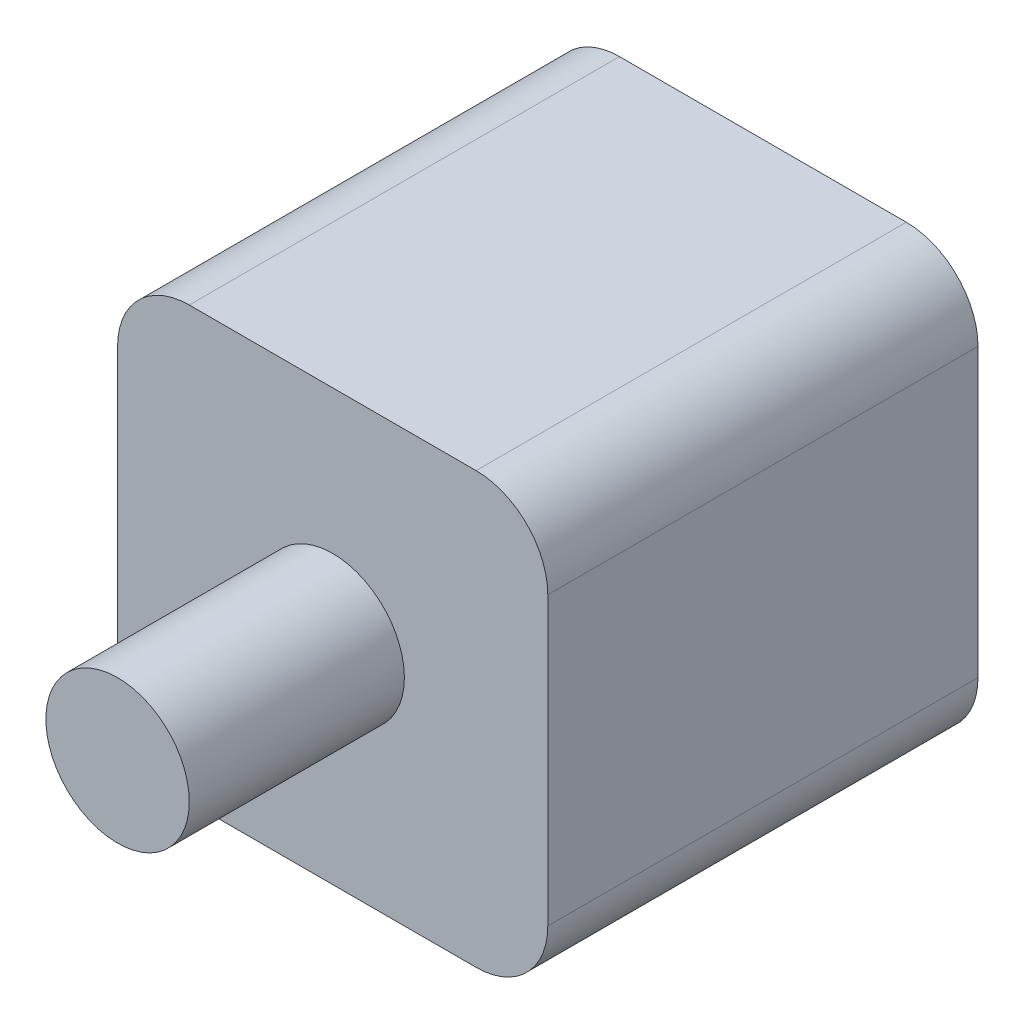
ISO-10303-21;
HEADER;
FILE_DESCRIPTION(('STEP AP214'),'2;1');
FILE_NAME('part.step','',(''),(''),'','','');
FILE_SCHEMA(('AUTOMOTIVE_DESIGN { 1 0 10303 214 1 1 1 1 }'));
ENDSEC;
DATA;
#1=APPLICATION_CONTEXT('core data for automotive mechanical design processes');
#2=APPLICATION_PROTOCOL_DEFINITION('international standard','automotive_design',2000,#1);
#3=PRODUCT_CONTEXT('',#1,'mechanical');
#4=PRODUCT('Part','Part','',(#3));
#5=PRODUCT_RELATED_PRODUCT_CATEGORY('part','',(#4));
#6=PRODUCT_DEFINITION_FORMATION('','',#4);
#7=PRODUCT_DEFINITION_CONTEXT('part definition',#1,'design');
#8=PRODUCT_DEFINITION('design','',#6,#7);
#9=PRODUCT_DEFINITION_SHAPE('','',#8);
#10=(LENGTH_UNIT() NAMED_UNIT(*) SI_UNIT(.MILLI.,.METRE.));
#11=(NAMED_UNIT(*) PLANE_ANGLE_UNIT() SI_UNIT($,.RADIAN.));
#12=(NAMED_UNIT(*) SI_UNIT($,.STERADIAN.) SOLID_ANGLE_UNIT());
#13=UNCERTAINTY_MEASURE_WITH_UNIT(LENGTH_MEASURE(1.E-05),#10,'distance_accuracy_value','');
#14=(GEOMETRIC_REPRESENTATION_CONTEXT(3) GLOBAL_UNCERTAINTY_ASSIGNED_CONTEXT((#13)) GLOBAL_UNIT_ASSIGNED_CONTEXT((#10,
#11,#12)) REPRESENTATION_CONTEXT('',''));
#15=CARTESIAN_POINT('',(0.,0.,0.));
#16=DIRECTION('',(0.,0.,1.));
#17=DIRECTION('',(1.,0.,0.));
#18=AXIS2_PLACEMENT_3D('',#15,#16,#17);
#19=CARTESIAN_POINT('',(30.,30.,30.));
#20=DIRECTION('',(-1.,0.,0.));
#21=DIRECTION('',(0.,0.,1.));
#22=AXIS2_PLACEMENT_3D('',#19,#20,#21);
#23=PLANE('',#22);
#24=DIRECTION('',(0.,1.,0.));
#25=VECTOR('',#24,1.);
#26=CARTESIAN_POINT('',(30.,30.,30.));
#27=LINE('',#26,#25);
#28=CARTESIAN_POINT('',(30.,-20.,30.));
#29=VERTEX_POINT('',#28);
#30=CARTESIAN_POINT('',(30.,20.,30.));
#31=VERTEX_POINT('',#30);
#32=EDGE_CURVE('E132',#29,#31,#27,.T.);
#33=ORIENTED_EDGE('',*,*,#32,.F.);
#34=DIRECTION('',(0.,0.,-1.));
#35=VECTOR('',#34,1.);
#36=CARTESIAN_POINT('',(30.,-20.,30.));
#37=LINE('',#36,#35);
#38=CARTESIAN_POINT('',(30.,-20.,-30.));
#39=VERTEX_POINT('',#38);
#40=EDGE_CURVE('E159',#29,#39,#37,.T.);
#41=ORIENTED_EDGE('',*,*,#40,.T.);
#42=DIRECTION('',(0.,1.,0.));
#43=VECTOR('',#42,1.);
#44=CARTESIAN_POINT('',(30.,30.,-30.));
#45=LINE('',#44,#43);
#46=CARTESIAN_POINT('',(30.,20.,-30.));
#47=VERTEX_POINT('',#46);
#48=EDGE_CURVE('E167',#39,#47,#45,.T.);
#49=ORIENTED_EDGE('',*,*,#48,.T.);
#50=DIRECTION('',(0.,0.,-1.));
#51=VECTOR('',#50,1.);
#52=CARTESIAN_POINT('',(30.,20.,30.));
#53=LINE('',#52,#51);
#54=EDGE_CURVE('E157',#47,#31,#53,.F.);
#55=ORIENTED_EDGE('',*,*,#54,.T.);
#56=EDGE_LOOP('',(#33,#41,#49,#55));
#57=FACE_BOUND('',#56,.T.);
#58=ADVANCED_FACE('F41',(#57),#23,.F.);
#59=CARTESIAN_POINT('',(-30.,30.,30.));
#60=DIRECTION('',(0.,-1.,0.));
#61=DIRECTION('',(0.,0.,-1.));
#62=AXIS2_PLACEMENT_3D('',#59,#60,#61);
#63=PLANE('',#62);
#64=DIRECTION('',(-1.,0.,0.));
#65=VECTOR('',#64,1.);
#66=CARTESIAN_POINT('',(-30.,30.,-30.));
#67=LINE('',#66,#65);
#68=CARTESIAN_POINT('',(20.,30.,-30.));
#69=VERTEX_POINT('',#68);
#70=CARTESIAN_POINT('',(-20.,30.,-30.));
#71=VERTEX_POINT('',#70);
#72=EDGE_CURVE('E137',#69,#71,#67,.T.);
#73=ORIENTED_EDGE('',*,*,#72,.T.);
#74=DIRECTION('',(0.,0.,-1.));
#75=VECTOR('',#74,1.);
#76=CARTESIAN_POINT('',(-20.,30.,30.));
#77=LINE('',#76,#75);
#78=CARTESIAN_POINT('',(-20.,30.,30.));
#79=VERTEX_POINT('',#78);
#80=EDGE_CURVE('E11',#71,#79,#77,.F.);
#81=ORIENTED_EDGE('',*,*,#80,.T.);
#82=DIRECTION('',(-1.,0.,0.));
#83=VECTOR('',#82,1.);
#84=CARTESIAN_POINT('',(-30.,30.,30.));
#85=LINE('',#84,#83);
#86=CARTESIAN_POINT('',(20.,30.,30.));
#87=VERTEX_POINT('',#86);
#88=EDGE_CURVE('E135',#87,#79,#85,.T.);
#89=ORIENTED_EDGE('',*,*,#88,.F.);
#90=DIRECTION('',(0.,0.,-1.));
#91=VECTOR('',#90,1.);
#92=CARTESIAN_POINT('',(20.,30.,30.));
#93=LINE('',#92,#91);
#94=EDGE_CURVE('E49',#87,#69,#93,.T.);
#95=ORIENTED_EDGE('',*,*,#94,.T.);
#96=EDGE_LOOP('',(#73,#81,#89,#95));
#97=FACE_BOUND('',#96,.T.);
#98=ADVANCED_FACE('F164',(#97),#63,.F.);
#99=CARTESIAN_POINT('',(-30.,30.,30.));
#100=DIRECTION('',(1.,0.,0.));
#101=DIRECTION('',(0.,0.,-1.));
#102=AXIS2_PLACEMENT_3D('',#99,#100,#101);
#103=PLANE('',#102);
#104=DIRECTION('',(0.,-1.,0.));
#105=VECTOR('',#104,1.);
#106=CARTESIAN_POINT('',(-30.,30.,-30.));
#107=LINE('',#106,#105);
#108=CARTESIAN_POINT('',(-30.,20.,-30.));
#109=VERTEX_POINT('',#108);
#110=CARTESIAN_POINT('',(-30.,-20.,-30.));
#111=VERTEX_POINT('',#110);
#112=EDGE_CURVE('E133',#109,#111,#107,.T.);
#113=ORIENTED_EDGE('',*,*,#112,.T.);
#114=DIRECTION('',(0.,0.,-1.));
#115=VECTOR('',#114,1.);
#116=CARTESIAN_POINT('',(-30.,-20.,30.));
#117=LINE('',#116,#115);
#118=CARTESIAN_POINT('',(-30.,-20.,30.));
#119=VERTEX_POINT('',#118);
#120=EDGE_CURVE('E111',#111,#119,#117,.F.);
#121=ORIENTED_EDGE('',*,*,#120,.T.);
#122=DIRECTION('',(0.,-1.,0.));
#123=VECTOR('',#122,1.);
#124=CARTESIAN_POINT('',(-30.,30.,30.));
#125=LINE('',#124,#123);
#126=CARTESIAN_POINT('',(-30.,20.,30.));
#127=VERTEX_POINT('',#126);
#128=EDGE_CURVE('E172',#127,#119,#125,.T.);
#129=ORIENTED_EDGE('',*,*,#128,.F.);
#130=DIRECTION('',(0.,0.,-1.));
#131=VECTOR('',#130,1.);
#132=CARTESIAN_POINT('',(-30.,20.,30.));
#133=LINE('',#132,#131);
#134=EDGE_CURVE('E116',#127,#109,#133,.T.);
#135=ORIENTED_EDGE('',*,*,#134,.T.);
#136=EDGE_LOOP('',(#113,#121,#129,#135));
#137=FACE_BOUND('',#136,.T.);
#138=ADVANCED_FACE('F196',(#137),#103,.F.);
#139=CARTESIAN_POINT('',(-30.,-30.,30.));
#140=DIRECTION('',(0.,1.,0.));
#141=DIRECTION('',(0.,0.,1.));
#142=AXIS2_PLACEMENT_3D('',#139,#140,#141);
#143=PLANE('',#142);
#144=DIRECTION('',(1.,0.,0.));
#145=VECTOR('',#144,1.);
#146=CARTESIAN_POINT('',(-30.,-30.,30.));
#147=LINE('',#146,#145);
#148=CARTESIAN_POINT('',(-20.,-30.,30.));
#149=VERTEX_POINT('',#148);
#150=CARTESIAN_POINT('',(20.,-30.,30.));
#151=VERTEX_POINT('',#150);
#152=EDGE_CURVE('E126',#149,#151,#147,.T.);
#153=ORIENTED_EDGE('',*,*,#152,.F.);
#154=DIRECTION('',(0.,0.,-1.));
#155=VECTOR('',#154,1.);
#156=CARTESIAN_POINT('',(-20.,-30.,30.));
#157=LINE('',#156,#155);
#158=CARTESIAN_POINT('',(-20.,-30.,-30.));
#159=VERTEX_POINT('',#158);
#160=EDGE_CURVE('E110',#149,#159,#157,.T.);
#161=ORIENTED_EDGE('',*,*,#160,.T.);
#162=DIRECTION('',(1.,0.,0.));
#163=VECTOR('',#162,1.);
#164=CARTESIAN_POINT('',(-30.,-30.,-30.));
#165=LINE('',#164,#163);
#166=CARTESIAN_POINT('',(20.,-30.,-30.));
#167=VERTEX_POINT('',#166);
#168=EDGE_CURVE('E123',#159,#167,#165,.T.);
#169=ORIENTED_EDGE('',*,*,#168,.T.);
#170=DIRECTION('',(0.,0.,-1.));
#171=VECTOR('',#170,1.);
#172=CARTESIAN_POINT('',(20.,-30.,30.));
#173=LINE('',#172,#171);
#174=EDGE_CURVE('E128',#167,#151,#173,.F.);
#175=ORIENTED_EDGE('',*,*,#174,.T.);
#176=EDGE_LOOP('',(#153,#161,#169,#175));
#177=FACE_BOUND('',#176,.T.);
#178=ADVANCED_FACE('F122',(#177),#143,.F.);
#179=CARTESIAN_POINT('',(0.,0.,30.));
#180=DIRECTION('',(0.,0.,1.));
#181=DIRECTION('',(1.,0.,0.));
#182=AXIS2_PLACEMENT_3D('',#179,#180,#181);
#183=PLANE('',#182);
#184=CARTESIAN_POINT('',(0.,0.,30.));
#185=DIRECTION('',(0.,0.,1.));
#186=DIRECTION('',(1.,0.,0.));
#187=AXIS2_PLACEMENT_3D('',#184,#185,#186);
#188=CIRCLE('',#187,10.);
#189=CARTESIAN_POINT('',(10.,0.,30.));
#190=VERTEX_POINT('',#189);
#191=EDGE_CURVE('E141',#190,#190,#188,.T.);
#192=ORIENTED_EDGE('',*,*,#191,.F.);
#193=EDGE_LOOP('',(#192));
#194=FACE_BOUND('',#193,.T.);
#195=ORIENTED_EDGE('',*,*,#128,.T.);
#196=CARTESIAN_POINT('',(-20.,-20.,30.));
#197=DIRECTION('',(0.,0.,1.));
#198=DIRECTION('',(1.,0.,0.));
#199=AXIS2_PLACEMENT_3D('',#196,#197,#198);
#200=CIRCLE('',#199,10.);
#201=EDGE_CURVE('E155',#119,#149,#200,.T.);
#202=ORIENTED_EDGE('',*,*,#201,.T.);
#203=ORIENTED_EDGE('',*,*,#152,.T.);
#204=CARTESIAN_POINT('',(20.,-20.,30.));
#205=DIRECTION('',(0.,0.,1.));
#206=DIRECTION('',(1.,0.,0.));
#207=AXIS2_PLACEMENT_3D('',#204,#205,#206);
#208=CIRCLE('',#207,10.);
#209=EDGE_CURVE('E153',#151,#29,#208,.T.);
#210=ORIENTED_EDGE('',*,*,#209,.T.);
#211=ORIENTED_EDGE('',*,*,#32,.T.);
#212=CARTESIAN_POINT('',(20.,20.,30.));
#213=DIRECTION('',(0.,0.,1.));
#214=DIRECTION('',(1.,0.,0.));
#215=AXIS2_PLACEMENT_3D('',#212,#213,#214);
#216=CIRCLE('',#215,10.);
#217=EDGE_CURVE('E61',#31,#87,#216,.T.);
#218=ORIENTED_EDGE('',*,*,#217,.T.);
#219=ORIENTED_EDGE('',*,*,#88,.T.);
#220=CARTESIAN_POINT('',(-20.,20.,30.));
#221=DIRECTION('',(0.,0.,1.));
#222=DIRECTION('',(1.,0.,0.));
#223=AXIS2_PLACEMENT_3D('',#220,#221,#222);
#224=CIRCLE('',#223,10.);
#225=EDGE_CURVE('E151',#79,#127,#224,.T.);
#226=ORIENTED_EDGE('',*,*,#225,.T.);
#227=EDGE_LOOP('',(#195,#202,#203,#210,#211,#218,#219,#226));
#228=FACE_BOUND('',#227,.T.);
#229=ADVANCED_FACE('F189',(#194,#228),#183,.T.);
#230=CARTESIAN_POINT('',(0.,0.,-30.));
#231=DIRECTION('',(0.,0.,1.));
#232=DIRECTION('',(1.,0.,0.));
#233=AXIS2_PLACEMENT_3D('',#230,#231,#232);
#234=PLANE('',#233);
#235=ORIENTED_EDGE('',*,*,#168,.F.);
#236=CARTESIAN_POINT('',(-20.,-20.,-30.));
#237=DIRECTION('',(0.,0.,1.));
#238=DIRECTION('',(1.,0.,0.));
#239=AXIS2_PLACEMENT_3D('',#236,#237,#238);
#240=CIRCLE('',#239,10.);
#241=EDGE_CURVE('E106',#159,#111,#240,.F.);
#242=ORIENTED_EDGE('',*,*,#241,.T.);
#243=ORIENTED_EDGE('',*,*,#112,.F.);
#244=CARTESIAN_POINT('',(-20.,20.,-30.));
#245=DIRECTION('',(0.,0.,1.));
#246=DIRECTION('',(1.,0.,0.));
#247=AXIS2_PLACEMENT_3D('',#244,#245,#246);
#248=CIRCLE('',#247,10.);
#249=EDGE_CURVE('E144',#109,#71,#248,.F.);
#250=ORIENTED_EDGE('',*,*,#249,.T.);
#251=ORIENTED_EDGE('',*,*,#72,.F.);
#252=CARTESIAN_POINT('',(20.,20.,-30.));
#253=DIRECTION('',(0.,0.,1.));
#254=DIRECTION('',(1.,0.,0.));
#255=AXIS2_PLACEMENT_3D('',#252,#253,#254);
#256=CIRCLE('',#255,10.);
#257=EDGE_CURVE('E127',#69,#47,#256,.F.);
#258=ORIENTED_EDGE('',*,*,#257,.T.);
#259=ORIENTED_EDGE('',*,*,#48,.F.);
#260=CARTESIAN_POINT('',(20.,-20.,-30.));
#261=DIRECTION('',(0.,0.,1.));
#262=DIRECTION('',(1.,0.,0.));
#263=AXIS2_PLACEMENT_3D('',#260,#261,#262);
#264=CIRCLE('',#263,10.);
#265=EDGE_CURVE('E117',#39,#167,#264,.F.);
#266=ORIENTED_EDGE('',*,*,#265,.T.);
#267=EDGE_LOOP('',(#235,#242,#243,#250,#251,#258,#259,#266));
#268=FACE_BOUND('',#267,.T.);
#269=ADVANCED_FACE('F130',(#268),#234,.F.);
#270=CARTESIAN_POINT('',(0.,0.,60.));
#271=DIRECTION('',(0.,0.,-1.));
#272=DIRECTION('',(-1.,0.,0.));
#273=AXIS2_PLACEMENT_3D('',#270,#271,#272);
#274=CYLINDRICAL_SURFACE('',#273,10.);
#275=CARTESIAN_POINT('',(0.,0.,60.));
#276=DIRECTION('',(0.,0.,1.));
#277=DIRECTION('',(1.,0.,0.));
#278=AXIS2_PLACEMENT_3D('',#275,#276,#277);
#279=CIRCLE('',#278,10.);
#280=CARTESIAN_POINT('',(10.,0.,60.));
#281=VERTEX_POINT('',#280);
#282=EDGE_CURVE('E168',#281,#281,#279,.T.);
#283=ORIENTED_EDGE('',*,*,#282,.F.);
#284=EDGE_LOOP('',(#283));
#285=FACE_BOUND('',#284,.T.);
#286=ORIENTED_EDGE('',*,*,#191,.T.);
#287=EDGE_LOOP('',(#286));
#288=FACE_BOUND('',#287,.T.);
#289=ADVANCED_FACE('F183',(#285,#288),#274,.T.);
#290=CARTESIAN_POINT('',(0.,0.,60.));
#291=DIRECTION('',(0.,0.,1.));
#292=DIRECTION('',(1.,0.,0.));
#293=AXIS2_PLACEMENT_3D('',#290,#291,#292);
#294=PLANE('',#293);
#295=ORIENTED_EDGE('',*,*,#282,.T.);
#296=EDGE_LOOP('',(#295));
#297=FACE_BOUND('',#296,.T.);
#298=ADVANCED_FACE('F181',(#297),#294,.T.);
#299=CARTESIAN_POINT('',(-20.,-20.,30.));
#300=DIRECTION('',(0.,0.,-1.));
#301=DIRECTION('',(-1.,0.,0.));
#302=AXIS2_PLACEMENT_3D('',#299,#300,#301);
#303=CYLINDRICAL_SURFACE('',#302,10.);
#304=ORIENTED_EDGE('',*,*,#201,.F.);
#305=ORIENTED_EDGE('',*,*,#120,.F.);
#306=ORIENTED_EDGE('',*,*,#241,.F.);
#307=ORIENTED_EDGE('',*,*,#160,.F.);
#308=EDGE_LOOP('',(#304,#305,#306,#307));
#309=FACE_BOUND('',#308,.T.);
#310=ADVANCED_FACE('F109',(#309),#303,.T.);
#311=CARTESIAN_POINT('',(20.,-20.,30.));
#312=DIRECTION('',(0.,0.,-1.));
#313=DIRECTION('',(-1.,0.,0.));
#314=AXIS2_PLACEMENT_3D('',#311,#312,#313);
#315=CYLINDRICAL_SURFACE('',#314,10.);
#316=ORIENTED_EDGE('',*,*,#209,.F.);
#317=ORIENTED_EDGE('',*,*,#174,.F.);
#318=ORIENTED_EDGE('',*,*,#265,.F.);
#319=ORIENTED_EDGE('',*,*,#40,.F.);
#320=EDGE_LOOP('',(#316,#317,#318,#319));
#321=FACE_BOUND('',#320,.T.);
#322=ADVANCED_FACE('F200',(#321),#315,.T.);
#323=CARTESIAN_POINT('',(-20.,20.,30.));
#324=DIRECTION('',(0.,0.,-1.));
#325=DIRECTION('',(-1.,0.,0.));
#326=AXIS2_PLACEMENT_3D('',#323,#324,#325);
#327=CYLINDRICAL_SURFACE('',#326,10.);
#328=ORIENTED_EDGE('',*,*,#225,.F.);
#329=ORIENTED_EDGE('',*,*,#80,.F.);
#330=ORIENTED_EDGE('',*,*,#249,.F.);
#331=ORIENTED_EDGE('',*,*,#134,.F.);
#332=EDGE_LOOP('',(#328,#329,#330,#331));
#333=FACE_BOUND('',#332,.T.);
#334=ADVANCED_FACE('F198',(#333),#327,.T.);
#335=CARTESIAN_POINT('',(20.,20.,30.));
#336=DIRECTION('',(0.,0.,-1.));
#337=DIRECTION('',(-1.,0.,0.));
#338=AXIS2_PLACEMENT_3D('',#335,#336,#337);
#339=CYLINDRICAL_SURFACE('',#338,10.);
#340=ORIENTED_EDGE('',*,*,#217,.F.);
#341=ORIENTED_EDGE('',*,*,#54,.F.);
#342=ORIENTED_EDGE('',*,*,#257,.F.);
#343=ORIENTED_EDGE('',*,*,#94,.F.);
#344=EDGE_LOOP('',(#340,#341,#342,#343));
#345=FACE_BOUND('',#344,.T.);
#346=ADVANCED_FACE('F43',(#345),#339,.T.);
#347=CLOSED_SHELL('',(#58,#98,#138,#178,#229,#269,#289,#298,#310,#322,#334,#346));
#348=MANIFOLD_SOLID_BREP('B2',#347);
#349=ADVANCED_BREP_SHAPE_REPRESENTATION('',(#18,#348),#14);
#350=SHAPE_DEFINITION_REPRESENTATION(#9,#349);
ENDSEC;
END-ISO-10303-21;
